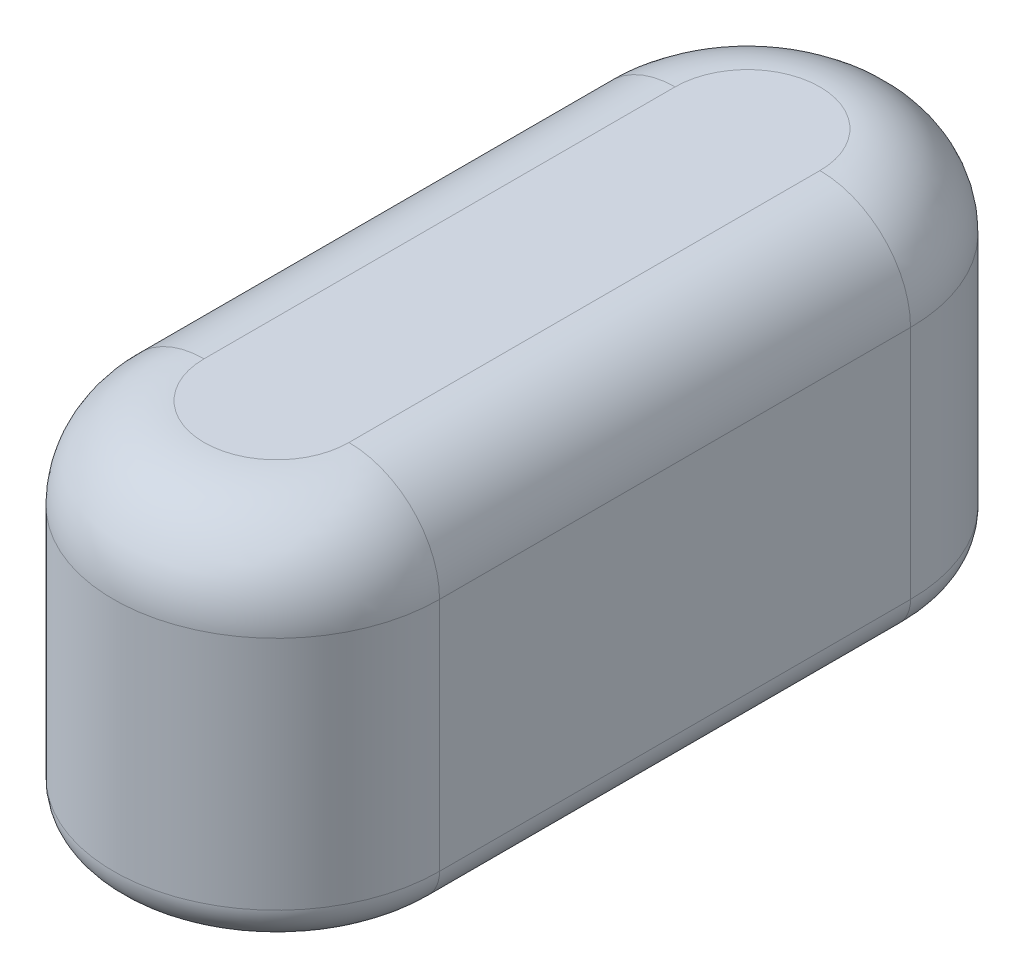
ISO-10303-21;
HEADER;
FILE_DESCRIPTION(('STEP AP214'),'2;1');
FILE_NAME('part.step','',(''),(''),'','','');
FILE_SCHEMA(('AUTOMOTIVE_DESIGN { 1 0 10303 214 1 1 1 1 }'));
ENDSEC;
DATA;
#1=APPLICATION_CONTEXT('core data for automotive mechanical design processes');
#2=APPLICATION_PROTOCOL_DEFINITION('international standard','automotive_design',2000,#1);
#3=PRODUCT_CONTEXT('',#1,'mechanical');
#4=PRODUCT('Part','Part','',(#3));
#5=PRODUCT_RELATED_PRODUCT_CATEGORY('part','',(#4));
#6=PRODUCT_DEFINITION_FORMATION('','',#4);
#7=PRODUCT_DEFINITION_CONTEXT('part definition',#1,'design');
#8=PRODUCT_DEFINITION('design','',#6,#7);
#9=PRODUCT_DEFINITION_SHAPE('','',#8);
#10=(LENGTH_UNIT() NAMED_UNIT(*) SI_UNIT(.MILLI.,.METRE.));
#11=(NAMED_UNIT(*) PLANE_ANGLE_UNIT() SI_UNIT($,.RADIAN.));
#12=(NAMED_UNIT(*) SI_UNIT($,.STERADIAN.) SOLID_ANGLE_UNIT());
#13=UNCERTAINTY_MEASURE_WITH_UNIT(LENGTH_MEASURE(1.E-05),#10,'distance_accuracy_value','');
#14=(GEOMETRIC_REPRESENTATION_CONTEXT(3) GLOBAL_UNCERTAINTY_ASSIGNED_CONTEXT((#13)) GLOBAL_UNIT_ASSIGNED_CONTEXT((#10,
#11,#12)) REPRESENTATION_CONTEXT('',''));
#15=CARTESIAN_POINT('',(0.,0.,0.));
#16=DIRECTION('',(0.,0.,1.));
#17=DIRECTION('',(1.,0.,0.));
#18=AXIS2_PLACEMENT_3D('',#15,#16,#17);
#19=CARTESIAN_POINT('',(0.,0.,330.2));
#20=DIRECTION('',(0.,1.,0.));
#21=DIRECTION('',(0.,0.,1.));
#22=AXIS2_PLACEMENT_3D('',#19,#20,#21);
#23=PLANE('',#22);
#24=CARTESIAN_POINT('',(0.,0.,660.4));
#25=DIRECTION('',(0.,1.,0.));
#26=DIRECTION('',(1.,0.,0.));
#27=AXIS2_PLACEMENT_3D('',#24,#25,#26);
#28=CIRCLE('',#27,177.8);
#29=CARTESIAN_POINT('',(-177.8,0.,660.4));
#30=VERTEX_POINT('',#29);
#31=CARTESIAN_POINT('',(177.8,0.,660.4));
#32=VERTEX_POINT('',#31);
#33=EDGE_CURVE('E156',#30,#32,#28,.T.);
#34=ORIENTED_EDGE('',*,*,#33,.F.);
#35=DIRECTION('',(0.,0.,-1.));
#36=VECTOR('',#35,1.);
#37=CARTESIAN_POINT('',(-177.8,0.,330.2));
#38=LINE('',#37,#36);
#39=CARTESIAN_POINT('',(-177.8,0.,0.));
#40=VERTEX_POINT('',#39);
#41=EDGE_CURVE('E159',#30,#40,#38,.T.);
#42=ORIENTED_EDGE('',*,*,#41,.T.);
#43=CARTESIAN_POINT('',(0.,0.,0.));
#44=DIRECTION('',(0.,-1.,0.));
#45=DIRECTION('',(1.,0.,0.));
#46=AXIS2_PLACEMENT_3D('',#43,#44,#45);
#47=CIRCLE('',#46,177.8);
#48=CARTESIAN_POINT('',(177.8,0.,0.));
#49=VERTEX_POINT('',#48);
#50=EDGE_CURVE('E217',#40,#49,#47,.T.);
#51=ORIENTED_EDGE('',*,*,#50,.T.);
#52=DIRECTION('',(0.,0.,-1.));
#53=VECTOR('',#52,1.);
#54=CARTESIAN_POINT('',(177.8,0.,330.2));
#55=LINE('',#54,#53);
#56=EDGE_CURVE('E11',#32,#49,#55,.T.);
#57=ORIENTED_EDGE('',*,*,#56,.F.);
#58=EDGE_LOOP('',(#34,#42,#51,#57));
#59=FACE_BOUND('',#58,.T.);
#60=ADVANCED_FACE('F42',(#59),#23,.F.);
#61=CARTESIAN_POINT('',(177.8,50.8,330.2));
#62=DIRECTION('',(0.,0.,-1.));
#63=DIRECTION('',(-1.,0.,0.));
#64=AXIS2_PLACEMENT_3D('',#61,#62,#63);
#65=CYLINDRICAL_SURFACE('',#64,50.8);
#66=CARTESIAN_POINT('',(177.8,50.8,0.));
#67=DIRECTION('',(0.,0.,1.));
#68=DIRECTION('',(1.,0.,0.));
#69=AXIS2_PLACEMENT_3D('',#66,#67,#68);
#70=CIRCLE('',#69,50.8);
#71=CARTESIAN_POINT('',(228.6,50.8,0.));
#72=VERTEX_POINT('',#71);
#73=EDGE_CURVE('E57',#49,#72,#70,.T.);
#74=ORIENTED_EDGE('',*,*,#73,.T.);
#75=DIRECTION('',(0.,0.,-1.));
#76=VECTOR('',#75,1.);
#77=CARTESIAN_POINT('',(228.6,50.8,330.2));
#78=LINE('',#77,#76);
#79=CARTESIAN_POINT('',(228.6,50.8,660.4));
#80=VERTEX_POINT('',#79);
#81=EDGE_CURVE('E50',#80,#72,#78,.T.);
#82=ORIENTED_EDGE('',*,*,#81,.F.);
#83=CARTESIAN_POINT('',(177.8,50.8,660.4));
#84=DIRECTION('',(0.,0.,1.));
#85=DIRECTION('',(1.,0.,0.));
#86=AXIS2_PLACEMENT_3D('',#83,#84,#85);
#87=CIRCLE('',#86,50.8);
#88=EDGE_CURVE('E260',#32,#80,#87,.T.);
#89=ORIENTED_EDGE('',*,*,#88,.F.);
#90=ORIENTED_EDGE('',*,*,#56,.T.);
#91=EDGE_LOOP('',(#74,#82,#89,#90));
#92=FACE_BOUND('',#91,.T.);
#93=ADVANCED_FACE('F259',(#92),#65,.T.);
#94=CARTESIAN_POINT('',(228.6,50.8,330.2));
#95=DIRECTION('',(-1.,0.,0.));
#96=DIRECTION('',(0.,-1.,0.));
#97=AXIS2_PLACEMENT_3D('',#94,#95,#96);
#98=PLANE('',#97);
#99=DIRECTION('',(0.,1.,0.));
#100=VECTOR('',#99,1.);
#101=CARTESIAN_POINT('',(228.6,50.8,0.));
#102=LINE('',#101,#100);
#103=CARTESIAN_POINT('',(228.6,381.,0.));
#104=VERTEX_POINT('',#103);
#105=EDGE_CURVE('E220',#72,#104,#102,.T.);
#106=ORIENTED_EDGE('',*,*,#105,.T.);
#107=DIRECTION('',(0.,0.,-1.));
#108=VECTOR('',#107,1.);
#109=CARTESIAN_POINT('',(228.6,381.,330.2));
#110=LINE('',#109,#108);
#111=CARTESIAN_POINT('',(228.6,381.,660.4));
#112=VERTEX_POINT('',#111);
#113=EDGE_CURVE('E249',#112,#104,#110,.T.);
#114=ORIENTED_EDGE('',*,*,#113,.F.);
#115=DIRECTION('',(0.,1.,0.));
#116=VECTOR('',#115,1.);
#117=CARTESIAN_POINT('',(228.6,50.8,660.4));
#118=LINE('',#117,#116);
#119=EDGE_CURVE('E257',#80,#112,#118,.T.);
#120=ORIENTED_EDGE('',*,*,#119,.F.);
#121=ORIENTED_EDGE('',*,*,#81,.T.);
#122=EDGE_LOOP('',(#106,#114,#120,#121));
#123=FACE_BOUND('',#122,.T.);
#124=ADVANCED_FACE('F254',(#123),#98,.F.);
#125=CARTESIAN_POINT('',(101.6,381.,330.2));
#126=DIRECTION('',(0.,0.,-1.));
#127=DIRECTION('',(-1.,0.,0.));
#128=AXIS2_PLACEMENT_3D('',#125,#126,#127);
#129=CYLINDRICAL_SURFACE('',#128,127.);
#130=CARTESIAN_POINT('',(101.6,381.,0.));
#131=DIRECTION('',(0.,0.,1.));
#132=DIRECTION('',(-1.,0.,0.));
#133=AXIS2_PLACEMENT_3D('',#130,#131,#132);
#134=CIRCLE('',#133,127.);
#135=CARTESIAN_POINT('',(101.6,508.,0.));
#136=VERTEX_POINT('',#135);
#137=EDGE_CURVE('E223',#104,#136,#134,.T.);
#138=ORIENTED_EDGE('',*,*,#137,.T.);
#139=DIRECTION('',(0.,0.,-1.));
#140=VECTOR('',#139,1.);
#141=CARTESIAN_POINT('',(101.6,508.,330.2));
#142=LINE('',#141,#140);
#143=CARTESIAN_POINT('',(101.6,508.,660.4));
#144=VERTEX_POINT('',#143);
#145=EDGE_CURVE('E246',#144,#136,#142,.T.);
#146=ORIENTED_EDGE('',*,*,#145,.F.);
#147=CARTESIAN_POINT('',(101.6,381.,660.4));
#148=DIRECTION('',(0.,0.,1.));
#149=DIRECTION('',(-1.,0.,0.));
#150=AXIS2_PLACEMENT_3D('',#147,#148,#149);
#151=CIRCLE('',#150,127.);
#152=EDGE_CURVE('E265',#112,#144,#151,.T.);
#153=ORIENTED_EDGE('',*,*,#152,.F.);
#154=ORIENTED_EDGE('',*,*,#113,.T.);
#155=EDGE_LOOP('',(#138,#146,#153,#154));
#156=FACE_BOUND('',#155,.T.);
#157=ADVANCED_FACE('F297',(#156),#129,.T.);
#158=CARTESIAN_POINT('',(0.,508.,330.2));
#159=DIRECTION('',(0.,-1.,0.));
#160=DIRECTION('',(0.,0.,-1.));
#161=AXIS2_PLACEMENT_3D('',#158,#159,#160);
#162=PLANE('',#161);
#163=DIRECTION('',(0.,0.,-1.));
#164=VECTOR('',#163,1.);
#165=CARTESIAN_POINT('',(-101.6,508.,330.2));
#166=LINE('',#165,#164);
#167=CARTESIAN_POINT('',(-101.6,508.,660.4));
#168=VERTEX_POINT('',#167);
#169=CARTESIAN_POINT('',(-101.6,508.,0.));
#170=VERTEX_POINT('',#169);
#171=EDGE_CURVE('E189',#168,#170,#166,.T.);
#172=ORIENTED_EDGE('',*,*,#171,.F.);
#173=CARTESIAN_POINT('',(0.,508.,660.4));
#174=DIRECTION('',(0.,1.,0.));
#175=DIRECTION('',(1.,0.,0.));
#176=AXIS2_PLACEMENT_3D('',#173,#174,#175);
#177=CIRCLE('',#176,101.6);
#178=EDGE_CURVE('E369',#168,#144,#177,.T.);
#179=ORIENTED_EDGE('',*,*,#178,.T.);
#180=ORIENTED_EDGE('',*,*,#145,.T.);
#181=CARTESIAN_POINT('',(0.,508.,0.));
#182=DIRECTION('',(0.,-1.,0.));
#183=DIRECTION('',(1.,0.,0.));
#184=AXIS2_PLACEMENT_3D('',#181,#182,#183);
#185=CIRCLE('',#184,101.6);
#186=EDGE_CURVE('E211',#170,#136,#185,.T.);
#187=ORIENTED_EDGE('',*,*,#186,.F.);
#188=EDGE_LOOP('',(#172,#179,#180,#187));
#189=FACE_BOUND('',#188,.T.);
#190=ADVANCED_FACE('F289',(#189),#162,.F.);
#191=CARTESIAN_POINT('',(0.,50.8,0.));
#192=DIRECTION('',(0.,-1.,0.));
#193=DIRECTION('',(1.,0.,0.));
#194=AXIS2_PLACEMENT_3D('',#191,#192,#193);
#195=TOROIDAL_SURFACE('',#194,177.8,50.8);
#196=CARTESIAN_POINT('',(0.,50.8,0.));
#197=DIRECTION('',(0.,-1.,0.));
#198=DIRECTION('',(1.,0.,0.));
#199=AXIS2_PLACEMENT_3D('',#196,#197,#198);
#200=CIRCLE('',#199,228.6);
#201=CARTESIAN_POINT('',(-228.6,50.8,0.));
#202=VERTEX_POINT('',#201);
#203=EDGE_CURVE('E215',#202,#72,#200,.T.);
#204=ORIENTED_EDGE('',*,*,#203,.T.);
#205=ORIENTED_EDGE('',*,*,#73,.F.);
#206=ORIENTED_EDGE('',*,*,#50,.F.);
#207=CARTESIAN_POINT('',(-177.8,50.8,0.));
#208=DIRECTION('',(0.,0.,-1.));
#209=DIRECTION('',(-1.,0.,0.));
#210=AXIS2_PLACEMENT_3D('',#207,#208,#209);
#211=CIRCLE('',#210,50.8);
#212=EDGE_CURVE('E178',#40,#202,#211,.T.);
#213=ORIENTED_EDGE('',*,*,#212,.T.);
#214=EDGE_LOOP('',(#204,#205,#206,#213));
#215=FACE_BOUND('',#214,.T.);
#216=ADVANCED_FACE('F287',(#215),#195,.T.);
#217=CARTESIAN_POINT('',(0.,0.,0.));
#218=DIRECTION('',(0.,-1.,0.));
#219=DIRECTION('',(1.,0.,0.));
#220=AXIS2_PLACEMENT_3D('',#217,#218,#219);
#221=CYLINDRICAL_SURFACE('',#220,228.6);
#222=CARTESIAN_POINT('',(0.,381.,0.));
#223=DIRECTION('',(0.,-1.,0.));
#224=DIRECTION('',(1.,0.,0.));
#225=AXIS2_PLACEMENT_3D('',#222,#223,#224);
#226=CIRCLE('',#225,228.6);
#227=CARTESIAN_POINT('',(-228.6,381.,0.));
#228=VERTEX_POINT('',#227);
#229=EDGE_CURVE('E213',#228,#104,#226,.T.);
#230=ORIENTED_EDGE('',*,*,#229,.T.);
#231=ORIENTED_EDGE('',*,*,#105,.F.);
#232=ORIENTED_EDGE('',*,*,#203,.F.);
#233=DIRECTION('',(0.,1.,0.));
#234=VECTOR('',#233,1.);
#235=CARTESIAN_POINT('',(-228.6,50.8,0.));
#236=LINE('',#235,#234);
#237=EDGE_CURVE('E183',#202,#228,#236,.T.);
#238=ORIENTED_EDGE('',*,*,#237,.T.);
#239=EDGE_LOOP('',(#230,#231,#232,#238));
#240=FACE_BOUND('',#239,.T.);
#241=ADVANCED_FACE('F279',(#240),#221,.T.);
#242=CARTESIAN_POINT('',(0.,381.,0.));
#243=DIRECTION('',(0.,-1.,0.));
#244=DIRECTION('',(1.,0.,0.));
#245=AXIS2_PLACEMENT_3D('',#242,#243,#244);
#246=DEGENERATE_TOROIDAL_SURFACE('',#245,101.6,127.,.T.);
#247=ORIENTED_EDGE('',*,*,#186,.T.);
#248=ORIENTED_EDGE('',*,*,#137,.F.);
#249=ORIENTED_EDGE('',*,*,#229,.F.);
#250=CARTESIAN_POINT('',(-101.6,381.,0.));
#251=DIRECTION('',(0.,0.,-1.));
#252=DIRECTION('',(1.,0.,0.));
#253=AXIS2_PLACEMENT_3D('',#250,#251,#252);
#254=CIRCLE('',#253,127.);
#255=EDGE_CURVE('E274',#228,#170,#254,.T.);
#256=ORIENTED_EDGE('',*,*,#255,.T.);
#257=EDGE_LOOP('',(#247,#248,#249,#256));
#258=FACE_BOUND('',#257,.T.);
#259=ADVANCED_FACE('F295',(#258),#246,.T.);
#260=CARTESIAN_POINT('',(-101.6,381.,330.2));
#261=DIRECTION('',(0.,0.,-1.));
#262=DIRECTION('',(-1.,0.,0.));
#263=AXIS2_PLACEMENT_3D('',#260,#261,#262);
#264=CYLINDRICAL_SURFACE('',#263,127.);
#265=ORIENTED_EDGE('',*,*,#255,.F.);
#266=DIRECTION('',(0.,0.,-1.));
#267=VECTOR('',#266,1.);
#268=CARTESIAN_POINT('',(-228.6,381.,330.2));
#269=LINE('',#268,#267);
#270=CARTESIAN_POINT('',(-228.6,381.,660.4));
#271=VERTEX_POINT('',#270);
#272=EDGE_CURVE('E181',#271,#228,#269,.T.);
#273=ORIENTED_EDGE('',*,*,#272,.F.);
#274=CARTESIAN_POINT('',(-101.6,381.,660.4));
#275=DIRECTION('',(0.,0.,-1.));
#276=DIRECTION('',(1.,0.,0.));
#277=AXIS2_PLACEMENT_3D('',#274,#275,#276);
#278=CIRCLE('',#277,127.);
#279=EDGE_CURVE('E391',#271,#168,#278,.T.);
#280=ORIENTED_EDGE('',*,*,#279,.T.);
#281=ORIENTED_EDGE('',*,*,#171,.T.);
#282=EDGE_LOOP('',(#265,#273,#280,#281));
#283=FACE_BOUND('',#282,.T.);
#284=ADVANCED_FACE('F392',(#283),#264,.T.);
#285=CARTESIAN_POINT('',(-228.6,50.8,330.2));
#286=DIRECTION('',(-1.,0.,0.));
#287=DIRECTION('',(0.,-1.,0.));
#288=AXIS2_PLACEMENT_3D('',#285,#286,#287);
#289=PLANE('',#288);
#290=ORIENTED_EDGE('',*,*,#237,.F.);
#291=DIRECTION('',(0.,0.,-1.));
#292=VECTOR('',#291,1.);
#293=CARTESIAN_POINT('',(-228.6,50.8,330.2));
#294=LINE('',#293,#292);
#295=CARTESIAN_POINT('',(-228.6,50.8,660.4));
#296=VERTEX_POINT('',#295);
#297=EDGE_CURVE('E179',#296,#202,#294,.T.);
#298=ORIENTED_EDGE('',*,*,#297,.F.);
#299=DIRECTION('',(0.,1.,0.));
#300=VECTOR('',#299,1.);
#301=CARTESIAN_POINT('',(-228.6,50.8,660.4));
#302=LINE('',#301,#300);
#303=EDGE_CURVE('E174',#296,#271,#302,.T.);
#304=ORIENTED_EDGE('',*,*,#303,.T.);
#305=ORIENTED_EDGE('',*,*,#272,.T.);
#306=EDGE_LOOP('',(#290,#298,#304,#305));
#307=FACE_BOUND('',#306,.T.);
#308=ADVANCED_FACE('F283',(#307),#289,.T.);
#309=CARTESIAN_POINT('',(-177.8,50.8,330.2));
#310=DIRECTION('',(0.,0.,-1.));
#311=DIRECTION('',(-1.,0.,0.));
#312=AXIS2_PLACEMENT_3D('',#309,#310,#311);
#313=CYLINDRICAL_SURFACE('',#312,50.8);
#314=ORIENTED_EDGE('',*,*,#212,.F.);
#315=ORIENTED_EDGE('',*,*,#41,.F.);
#316=CARTESIAN_POINT('',(-177.8,50.8,660.4));
#317=DIRECTION('',(0.,0.,-1.));
#318=DIRECTION('',(-1.,0.,0.));
#319=AXIS2_PLACEMENT_3D('',#316,#317,#318);
#320=CIRCLE('',#319,50.8);
#321=EDGE_CURVE('E168',#30,#296,#320,.T.);
#322=ORIENTED_EDGE('',*,*,#321,.T.);
#323=ORIENTED_EDGE('',*,*,#297,.T.);
#324=EDGE_LOOP('',(#314,#315,#322,#323));
#325=FACE_BOUND('',#324,.T.);
#326=ADVANCED_FACE('F176',(#325),#313,.T.);
#327=CARTESIAN_POINT('',(0.,50.8,660.4));
#328=DIRECTION('',(0.,-1.,0.));
#329=DIRECTION('',(1.,0.,0.));
#330=AXIS2_PLACEMENT_3D('',#327,#328,#329);
#331=TOROIDAL_SURFACE('',#330,177.8,50.8);
#332=CARTESIAN_POINT('',(0.,50.8,660.4));
#333=DIRECTION('',(0.,1.,0.));
#334=DIRECTION('',(1.,0.,0.));
#335=AXIS2_PLACEMENT_3D('',#332,#333,#334);
#336=CIRCLE('',#335,228.6);
#337=EDGE_CURVE('E165',#296,#80,#336,.T.);
#338=ORIENTED_EDGE('',*,*,#337,.F.);
#339=ORIENTED_EDGE('',*,*,#321,.F.);
#340=ORIENTED_EDGE('',*,*,#33,.T.);
#341=ORIENTED_EDGE('',*,*,#88,.T.);
#342=EDGE_LOOP('',(#338,#339,#340,#341));
#343=FACE_BOUND('',#342,.T.);
#344=ADVANCED_FACE('F169',(#343),#331,.T.);
#345=CARTESIAN_POINT('',(0.,0.,660.4));
#346=DIRECTION('',(0.,-1.,0.));
#347=DIRECTION('',(1.,0.,0.));
#348=AXIS2_PLACEMENT_3D('',#345,#346,#347);
#349=CYLINDRICAL_SURFACE('',#348,228.6);
#350=CARTESIAN_POINT('',(0.,381.,660.4));
#351=DIRECTION('',(0.,1.,0.));
#352=DIRECTION('',(1.,0.,0.));
#353=AXIS2_PLACEMENT_3D('',#350,#351,#352);
#354=CIRCLE('',#353,228.6);
#355=EDGE_CURVE('E372',#271,#112,#354,.T.);
#356=ORIENTED_EDGE('',*,*,#355,.F.);
#357=ORIENTED_EDGE('',*,*,#303,.F.);
#358=ORIENTED_EDGE('',*,*,#337,.T.);
#359=ORIENTED_EDGE('',*,*,#119,.T.);
#360=EDGE_LOOP('',(#356,#357,#358,#359));
#361=FACE_BOUND('',#360,.T.);
#362=ADVANCED_FACE('F397',(#361),#349,.T.);
#363=CARTESIAN_POINT('',(0.,381.,660.4));
#364=DIRECTION('',(0.,-1.,0.));
#365=DIRECTION('',(1.,0.,0.));
#366=AXIS2_PLACEMENT_3D('',#363,#364,#365);
#367=DEGENERATE_TOROIDAL_SURFACE('',#366,101.6,127.,.T.);
#368=ORIENTED_EDGE('',*,*,#178,.F.);
#369=ORIENTED_EDGE('',*,*,#279,.F.);
#370=ORIENTED_EDGE('',*,*,#355,.T.);
#371=ORIENTED_EDGE('',*,*,#152,.T.);
#372=EDGE_LOOP('',(#368,#369,#370,#371));
#373=FACE_BOUND('',#372,.T.);
#374=ADVANCED_FACE('F386',(#373),#367,.T.);
#375=CLOSED_SHELL('',(#60,#93,#124,#157,#190,#216,#241,#259,#284,#308,#326,#344,#362,#374));
#376=CARTESIAN_POINT('',(215.9,50.8,330.2));
#377=DIRECTION('',(1.,0.,0.));
#378=DIRECTION('',(0.,0.,-1.));
#379=AXIS2_PLACEMENT_3D('',#376,#377,#378);
#380=PLANE('',#379);
#381=DIRECTION('',(0.,-1.,0.));
#382=VECTOR('',#381,1.);
#383=CARTESIAN_POINT('',(215.9,50.8,0.));
#384=LINE('',#383,#382);
#385=CARTESIAN_POINT('',(215.9,381.,0.));
#386=VERTEX_POINT('',#385);
#387=CARTESIAN_POINT('',(215.9,50.8,0.));
#388=VERTEX_POINT('',#387);
#389=EDGE_CURVE('E229',#386,#388,#384,.T.);
#390=ORIENTED_EDGE('',*,*,#389,.T.);
#391=DIRECTION('',(0.,0.,-1.));
#392=VECTOR('',#391,1.);
#393=CARTESIAN_POINT('',(215.9,50.8,330.2));
#394=LINE('',#393,#392);
#395=CARTESIAN_POINT('',(215.9,50.8,660.4));
#396=VERTEX_POINT('',#395);
#397=EDGE_CURVE('E237',#396,#388,#394,.T.);
#398=ORIENTED_EDGE('',*,*,#397,.F.);
#399=DIRECTION('',(0.,-1.,0.));
#400=VECTOR('',#399,1.);
#401=CARTESIAN_POINT('',(215.9,50.8,660.4));
#402=LINE('',#401,#400);
#403=CARTESIAN_POINT('',(215.9,381.,660.4));
#404=VERTEX_POINT('',#403);
#405=EDGE_CURVE('E378',#404,#396,#402,.T.);
#406=ORIENTED_EDGE('',*,*,#405,.F.);
#407=DIRECTION('',(0.,0.,-1.));
#408=VECTOR('',#407,1.);
#409=CARTESIAN_POINT('',(215.9,381.,330.2));
#410=LINE('',#409,#408);
#411=EDGE_CURVE('E240',#404,#386,#410,.T.);
#412=ORIENTED_EDGE('',*,*,#411,.T.);
#413=EDGE_LOOP('',(#390,#398,#406,#412));
#414=FACE_BOUND('',#413,.T.);
#415=ADVANCED_FACE('F324',(#414),#380,.F.);
#416=CARTESIAN_POINT('',(101.6,381.,330.2));
#417=DIRECTION('',(0.,0.,-1.));
#418=DIRECTION('',(-1.,0.,0.));
#419=AXIS2_PLACEMENT_3D('',#416,#417,#418);
#420=CYLINDRICAL_SURFACE('',#419,114.3);
#421=CARTESIAN_POINT('',(101.6,381.,0.));
#422=DIRECTION('',(0.,0.,-1.));
#423=DIRECTION('',(-1.,0.,0.));
#424=AXIS2_PLACEMENT_3D('',#421,#422,#423);
#425=CIRCLE('',#424,114.3);
#426=CARTESIAN_POINT('',(101.6,495.3,0.));
#427=VERTEX_POINT('',#426);
#428=EDGE_CURVE('E226',#427,#386,#425,.T.);
#429=ORIENTED_EDGE('',*,*,#428,.T.);
#430=ORIENTED_EDGE('',*,*,#411,.F.);
#431=CARTESIAN_POINT('',(101.6,381.,660.4));
#432=DIRECTION('',(0.,0.,-1.));
#433=DIRECTION('',(-1.,0.,0.));
#434=AXIS2_PLACEMENT_3D('',#431,#432,#433);
#435=CIRCLE('',#434,114.3);
#436=CARTESIAN_POINT('',(101.6,495.3,660.4));
#437=VERTEX_POINT('',#436);
#438=EDGE_CURVE('E381',#437,#404,#435,.T.);
#439=ORIENTED_EDGE('',*,*,#438,.F.);
#440=DIRECTION('',(0.,0.,-1.));
#441=VECTOR('',#440,1.);
#442=CARTESIAN_POINT('',(101.6,495.3,330.2));
#443=LINE('',#442,#441);
#444=EDGE_CURVE('E243',#437,#427,#443,.T.);
#445=ORIENTED_EDGE('',*,*,#444,.T.);
#446=EDGE_LOOP('',(#429,#430,#439,#445));
#447=FACE_BOUND('',#446,.T.);
#448=ADVANCED_FACE('F320',(#447),#420,.F.);
#449=CARTESIAN_POINT('',(0.,381.,0.));
#450=DIRECTION('',(0.,-1.,0.));
#451=DIRECTION('',(1.,0.,0.));
#452=AXIS2_PLACEMENT_3D('',#449,#450,#451);
#453=DEGENERATE_TOROIDAL_SURFACE('',#452,101.6,114.3,.T.);
#454=CARTESIAN_POINT('',(0.,381.,0.));
#455=DIRECTION('',(0.,-1.,0.));
#456=DIRECTION('',(1.,0.,0.));
#457=AXIS2_PLACEMENT_3D('',#454,#455,#456);
#458=CIRCLE('',#457,215.9);
#459=CARTESIAN_POINT('',(-215.9,381.,0.));
#460=VERTEX_POINT('',#459);
#461=EDGE_CURVE('E207',#460,#386,#458,.T.);
#462=ORIENTED_EDGE('',*,*,#461,.T.);
#463=ORIENTED_EDGE('',*,*,#428,.F.);
#464=CARTESIAN_POINT('',(0.,495.3,0.));
#465=DIRECTION('',(0.,-1.,0.));
#466=DIRECTION('',(1.,0.,0.));
#467=AXIS2_PLACEMENT_3D('',#464,#465,#466);
#468=CIRCLE('',#467,101.6);
#469=CARTESIAN_POINT('',(-101.6,495.3,0.));
#470=VERTEX_POINT('',#469);
#471=EDGE_CURVE('E209',#470,#427,#468,.T.);
#472=ORIENTED_EDGE('',*,*,#471,.F.);
#473=CARTESIAN_POINT('',(-101.6,381.,0.));
#474=DIRECTION('',(0.,0.,1.));
#475=DIRECTION('',(1.,0.,0.));
#476=AXIS2_PLACEMENT_3D('',#473,#474,#475);
#477=CIRCLE('',#476,114.3);
#478=EDGE_CURVE('E271',#470,#460,#477,.T.);
#479=ORIENTED_EDGE('',*,*,#478,.T.);
#480=EDGE_LOOP('',(#462,#463,#472,#479));
#481=FACE_BOUND('',#480,.T.);
#482=ADVANCED_FACE('F323',(#481),#453,.F.);
#483=CARTESIAN_POINT('',(0.,0.,0.));
#484=DIRECTION('',(0.,-1.,0.));
#485=DIRECTION('',(1.,0.,0.));
#486=AXIS2_PLACEMENT_3D('',#483,#484,#485);
#487=CYLINDRICAL_SURFACE('',#486,215.9);
#488=CARTESIAN_POINT('',(0.,50.8,0.));
#489=DIRECTION('',(0.,-1.,0.));
#490=DIRECTION('',(1.,0.,0.));
#491=AXIS2_PLACEMENT_3D('',#488,#489,#490);
#492=CIRCLE('',#491,215.9);
#493=CARTESIAN_POINT('',(-215.9,50.8,0.));
#494=VERTEX_POINT('',#493);
#495=EDGE_CURVE('E205',#494,#388,#492,.T.);
#496=ORIENTED_EDGE('',*,*,#495,.T.);
#497=ORIENTED_EDGE('',*,*,#389,.F.);
#498=ORIENTED_EDGE('',*,*,#461,.F.);
#499=DIRECTION('',(0.,-1.,0.));
#500=VECTOR('',#499,1.);
#501=CARTESIAN_POINT('',(-215.9,50.8,0.));
#502=LINE('',#501,#500);
#503=EDGE_CURVE('E263',#460,#494,#502,.T.);
#504=ORIENTED_EDGE('',*,*,#503,.T.);
#505=EDGE_LOOP('',(#496,#497,#498,#504));
#506=FACE_BOUND('',#505,.T.);
#507=ADVANCED_FACE('F422',(#506),#487,.F.);
#508=CARTESIAN_POINT('',(0.,50.8,0.));
#509=DIRECTION('',(0.,-1.,0.));
#510=DIRECTION('',(1.,0.,0.));
#511=AXIS2_PLACEMENT_3D('',#508,#509,#510);
#512=TOROIDAL_SURFACE('',#511,177.8,38.1);
#513=CARTESIAN_POINT('',(0.,12.7,0.));
#514=DIRECTION('',(0.,-1.,0.));
#515=DIRECTION('',(1.,0.,0.));
#516=AXIS2_PLACEMENT_3D('',#513,#514,#515);
#517=CIRCLE('',#516,177.8);
#518=CARTESIAN_POINT('',(-177.8,12.7,0.));
#519=VERTEX_POINT('',#518);
#520=CARTESIAN_POINT('',(177.8,12.7,0.));
#521=VERTEX_POINT('',#520);
#522=EDGE_CURVE('E65',#519,#521,#517,.T.);
#523=ORIENTED_EDGE('',*,*,#522,.T.);
#524=CARTESIAN_POINT('',(177.8,50.8,0.));
#525=DIRECTION('',(0.,0.,-1.));
#526=DIRECTION('',(1.,0.,0.));
#527=AXIS2_PLACEMENT_3D('',#524,#525,#526);
#528=CIRCLE('',#527,38.1);
#529=EDGE_CURVE('E232',#388,#521,#528,.T.);
#530=ORIENTED_EDGE('',*,*,#529,.F.);
#531=ORIENTED_EDGE('',*,*,#495,.F.);
#532=CARTESIAN_POINT('',(-177.8,50.8,0.));
#533=DIRECTION('',(0.,0.,1.));
#534=DIRECTION('',(-1.,0.,0.));
#535=AXIS2_PLACEMENT_3D('',#532,#533,#534);
#536=CIRCLE('',#535,38.1);
#537=EDGE_CURVE('E261',#494,#519,#536,.T.);
#538=ORIENTED_EDGE('',*,*,#537,.T.);
#539=EDGE_LOOP('',(#523,#530,#531,#538));
#540=FACE_BOUND('',#539,.T.);
#541=ADVANCED_FACE('F332',(#540),#512,.F.);
#542=CARTESIAN_POINT('',(177.8,50.8,330.2));
#543=DIRECTION('',(0.,0.,-1.));
#544=DIRECTION('',(-1.,0.,0.));
#545=AXIS2_PLACEMENT_3D('',#542,#543,#544);
#546=CYLINDRICAL_SURFACE('',#545,38.1);
#547=ORIENTED_EDGE('',*,*,#529,.T.);
#548=DIRECTION('',(0.,0.,-1.));
#549=VECTOR('',#548,1.);
#550=CARTESIAN_POINT('',(177.8,12.7,330.2));
#551=LINE('',#550,#549);
#552=CARTESIAN_POINT('',(177.8,12.7,660.4));
#553=VERTEX_POINT('',#552);
#554=EDGE_CURVE('E234',#553,#521,#551,.T.);
#555=ORIENTED_EDGE('',*,*,#554,.F.);
#556=CARTESIAN_POINT('',(177.8,50.8,660.4));
#557=DIRECTION('',(0.,0.,-1.));
#558=DIRECTION('',(1.,0.,0.));
#559=AXIS2_PLACEMENT_3D('',#556,#557,#558);
#560=CIRCLE('',#559,38.1);
#561=EDGE_CURVE('E164',#396,#553,#560,.T.);
#562=ORIENTED_EDGE('',*,*,#561,.F.);
#563=ORIENTED_EDGE('',*,*,#397,.T.);
#564=EDGE_LOOP('',(#547,#555,#562,#563));
#565=FACE_BOUND('',#564,.T.);
#566=ADVANCED_FACE('F329',(#565),#546,.F.);
#567=CARTESIAN_POINT('',(0.,12.7,330.2));
#568=DIRECTION('',(0.,-1.,0.));
#569=DIRECTION('',(0.,0.,-1.));
#570=AXIS2_PLACEMENT_3D('',#567,#568,#569);
#571=PLANE('',#570);
#572=DIRECTION('',(0.,0.,-1.));
#573=VECTOR('',#572,1.);
#574=CARTESIAN_POINT('',(-177.8,12.7,330.2));
#575=LINE('',#574,#573);
#576=CARTESIAN_POINT('',(-177.8,12.7,660.4));
#577=VERTEX_POINT('',#576);
#578=EDGE_CURVE('E201',#577,#519,#575,.T.);
#579=ORIENTED_EDGE('',*,*,#578,.F.);
#580=CARTESIAN_POINT('',(0.,12.7,660.4));
#581=DIRECTION('',(0.,1.,0.));
#582=DIRECTION('',(1.,0.,0.));
#583=AXIS2_PLACEMENT_3D('',#580,#581,#582);
#584=CIRCLE('',#583,177.8);
#585=EDGE_CURVE('E346',#577,#553,#584,.T.);
#586=ORIENTED_EDGE('',*,*,#585,.T.);
#587=ORIENTED_EDGE('',*,*,#554,.T.);
#588=ORIENTED_EDGE('',*,*,#522,.F.);
#589=EDGE_LOOP('',(#579,#586,#587,#588));
#590=FACE_BOUND('',#589,.T.);
#591=ADVANCED_FACE('F331',(#590),#571,.F.);
#592=CARTESIAN_POINT('',(-177.8,50.8,330.2));
#593=DIRECTION('',(0.,0.,-1.));
#594=DIRECTION('',(-1.,0.,0.));
#595=AXIS2_PLACEMENT_3D('',#592,#593,#594);
#596=CYLINDRICAL_SURFACE('',#595,38.1);
#597=ORIENTED_EDGE('',*,*,#537,.F.);
#598=DIRECTION('',(0.,0.,-1.));
#599=VECTOR('',#598,1.);
#600=CARTESIAN_POINT('',(-215.9,50.8,330.2));
#601=LINE('',#600,#599);
#602=CARTESIAN_POINT('',(-215.9,50.8,660.4));
#603=VERTEX_POINT('',#602);
#604=EDGE_CURVE('E198',#603,#494,#601,.T.);
#605=ORIENTED_EDGE('',*,*,#604,.F.);
#606=CARTESIAN_POINT('',(-177.8,50.8,660.4));
#607=DIRECTION('',(0.,0.,1.));
#608=DIRECTION('',(-1.,0.,0.));
#609=AXIS2_PLACEMENT_3D('',#606,#607,#608);
#610=CIRCLE('',#609,38.1);
#611=EDGE_CURVE('E350',#603,#577,#610,.T.);
#612=ORIENTED_EDGE('',*,*,#611,.T.);
#613=ORIENTED_EDGE('',*,*,#578,.T.);
#614=EDGE_LOOP('',(#597,#605,#612,#613));
#615=FACE_BOUND('',#614,.T.);
#616=ADVANCED_FACE('F335',(#615),#596,.F.);
#617=CARTESIAN_POINT('',(-215.9,50.8,330.2));
#618=DIRECTION('',(1.,0.,0.));
#619=DIRECTION('',(0.,0.,-1.));
#620=AXIS2_PLACEMENT_3D('',#617,#618,#619);
#621=PLANE('',#620);
#622=ORIENTED_EDGE('',*,*,#503,.F.);
#623=DIRECTION('',(0.,0.,-1.));
#624=VECTOR('',#623,1.);
#625=CARTESIAN_POINT('',(-215.9,381.,330.2));
#626=LINE('',#625,#624);
#627=CARTESIAN_POINT('',(-215.9,381.,660.4));
#628=VERTEX_POINT('',#627);
#629=EDGE_CURVE('E195',#628,#460,#626,.T.);
#630=ORIENTED_EDGE('',*,*,#629,.F.);
#631=DIRECTION('',(0.,-1.,0.));
#632=VECTOR('',#631,1.);
#633=CARTESIAN_POINT('',(-215.9,50.8,660.4));
#634=LINE('',#633,#632);
#635=EDGE_CURVE('E354',#628,#603,#634,.T.);
#636=ORIENTED_EDGE('',*,*,#635,.T.);
#637=ORIENTED_EDGE('',*,*,#604,.T.);
#638=EDGE_LOOP('',(#622,#630,#636,#637));
#639=FACE_BOUND('',#638,.T.);
#640=ADVANCED_FACE('F340',(#639),#621,.T.);
#641=CARTESIAN_POINT('',(-101.6,381.,330.2));
#642=DIRECTION('',(0.,0.,-1.));
#643=DIRECTION('',(-1.,0.,0.));
#644=AXIS2_PLACEMENT_3D('',#641,#642,#643);
#645=CYLINDRICAL_SURFACE('',#644,114.3);
#646=ORIENTED_EDGE('',*,*,#478,.F.);
#647=DIRECTION('',(0.,0.,-1.));
#648=VECTOR('',#647,1.);
#649=CARTESIAN_POINT('',(-101.6,495.3,330.2));
#650=LINE('',#649,#648);
#651=CARTESIAN_POINT('',(-101.6,495.3,660.4));
#652=VERTEX_POINT('',#651);
#653=EDGE_CURVE('E192',#652,#470,#650,.T.);
#654=ORIENTED_EDGE('',*,*,#653,.F.);
#655=CARTESIAN_POINT('',(-101.6,381.,660.4));
#656=DIRECTION('',(0.,0.,1.));
#657=DIRECTION('',(1.,0.,0.));
#658=AXIS2_PLACEMENT_3D('',#655,#656,#657);
#659=CIRCLE('',#658,114.3);
#660=EDGE_CURVE('E358',#652,#628,#659,.T.);
#661=ORIENTED_EDGE('',*,*,#660,.T.);
#662=ORIENTED_EDGE('',*,*,#629,.T.);
#663=EDGE_LOOP('',(#646,#654,#661,#662));
#664=FACE_BOUND('',#663,.T.);
#665=ADVANCED_FACE('F317',(#664),#645,.F.);
#666=CARTESIAN_POINT('',(0.,495.3,330.2));
#667=DIRECTION('',(0.,1.,0.));
#668=DIRECTION('',(0.,0.,1.));
#669=AXIS2_PLACEMENT_3D('',#666,#667,#668);
#670=PLANE('',#669);
#671=CARTESIAN_POINT('',(0.,495.3,660.4));
#672=DIRECTION('',(0.,1.,0.));
#673=DIRECTION('',(1.,0.,0.));
#674=AXIS2_PLACEMENT_3D('',#671,#672,#673);
#675=CIRCLE('',#674,101.6);
#676=EDGE_CURVE('E366',#652,#437,#675,.T.);
#677=ORIENTED_EDGE('',*,*,#676,.F.);
#678=ORIENTED_EDGE('',*,*,#653,.T.);
#679=ORIENTED_EDGE('',*,*,#471,.T.);
#680=ORIENTED_EDGE('',*,*,#444,.F.);
#681=EDGE_LOOP('',(#677,#678,#679,#680));
#682=FACE_BOUND('',#681,.T.);
#683=ADVANCED_FACE('F313',(#682),#670,.F.);
#684=CARTESIAN_POINT('',(0.,50.8,660.4));
#685=DIRECTION('',(0.,-1.,0.));
#686=DIRECTION('',(1.,0.,0.));
#687=AXIS2_PLACEMENT_3D('',#684,#685,#686);
#688=TOROIDAL_SURFACE('',#687,177.8,38.1);
#689=ORIENTED_EDGE('',*,*,#585,.F.);
#690=ORIENTED_EDGE('',*,*,#611,.F.);
#691=CARTESIAN_POINT('',(0.,50.8,660.4));
#692=DIRECTION('',(0.,1.,0.));
#693=DIRECTION('',(1.,0.,0.));
#694=AXIS2_PLACEMENT_3D('',#691,#692,#693);
#695=CIRCLE('',#694,215.9);
#696=EDGE_CURVE('E356',#603,#396,#695,.T.);
#697=ORIENTED_EDGE('',*,*,#696,.T.);
#698=ORIENTED_EDGE('',*,*,#561,.T.);
#699=EDGE_LOOP('',(#689,#690,#697,#698));
#700=FACE_BOUND('',#699,.T.);
#701=ADVANCED_FACE('F316',(#700),#688,.F.);
#702=CARTESIAN_POINT('',(0.,0.,660.4));
#703=DIRECTION('',(0.,-1.,0.));
#704=DIRECTION('',(1.,0.,0.));
#705=AXIS2_PLACEMENT_3D('',#702,#703,#704);
#706=CYLINDRICAL_SURFACE('',#705,215.9);
#707=ORIENTED_EDGE('',*,*,#696,.F.);
#708=ORIENTED_EDGE('',*,*,#635,.F.);
#709=CARTESIAN_POINT('',(0.,381.,660.4));
#710=DIRECTION('',(0.,1.,0.));
#711=DIRECTION('',(1.,0.,0.));
#712=AXIS2_PLACEMENT_3D('',#709,#710,#711);
#713=CIRCLE('',#712,215.9);
#714=EDGE_CURVE('E363',#628,#404,#713,.T.);
#715=ORIENTED_EDGE('',*,*,#714,.T.);
#716=ORIENTED_EDGE('',*,*,#405,.T.);
#717=EDGE_LOOP('',(#707,#708,#715,#716));
#718=FACE_BOUND('',#717,.T.);
#719=ADVANCED_FACE('F532',(#718),#706,.F.);
#720=CARTESIAN_POINT('',(0.,381.,660.4));
#721=DIRECTION('',(0.,-1.,0.));
#722=DIRECTION('',(1.,0.,0.));
#723=AXIS2_PLACEMENT_3D('',#720,#721,#722);
#724=DEGENERATE_TOROIDAL_SURFACE('',#723,101.6,114.3,.T.);
#725=ORIENTED_EDGE('',*,*,#714,.F.);
#726=ORIENTED_EDGE('',*,*,#660,.F.);
#727=ORIENTED_EDGE('',*,*,#676,.T.);
#728=ORIENTED_EDGE('',*,*,#438,.T.);
#729=EDGE_LOOP('',(#725,#726,#727,#728));
#730=FACE_BOUND('',#729,.T.);
#731=ADVANCED_FACE('F542',(#730),#724,.F.);
#732=CLOSED_SHELL('',(#415,#448,#482,#507,#541,#566,#591,#616,#640,#665,#683,#701,#719,#731));
#733=ORIENTED_CLOSED_SHELL('',*,#732,.T.);
#734=BREP_WITH_VOIDS('B2',#375,(#733));
#735=ADVANCED_BREP_SHAPE_REPRESENTATION('',(#18,#734),#14);
#736=SHAPE_DEFINITION_REPRESENTATION(#9,#735);
ENDSEC;
END-ISO-10303-21;
